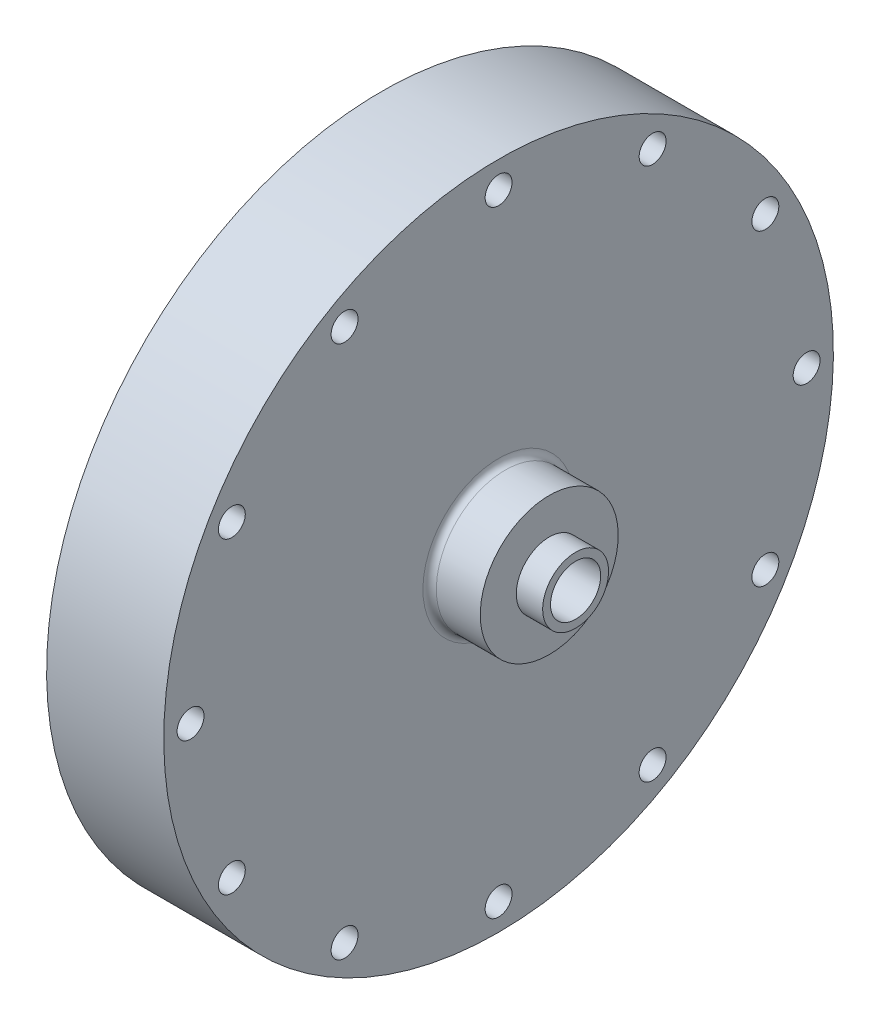
ISO-10303-21;
HEADER;
FILE_DESCRIPTION(('STEP AP214'),'2;1');
FILE_NAME('part.step','',(''),(''),'','','');
FILE_SCHEMA(('AUTOMOTIVE_DESIGN { 1 0 10303 214 1 1 1 1 }'));
ENDSEC;
DATA;
#1=APPLICATION_CONTEXT('core data for automotive mechanical design processes');
#2=APPLICATION_PROTOCOL_DEFINITION('international standard','automotive_design',2000,#1);
#3=PRODUCT_CONTEXT('',#1,'mechanical');
#4=PRODUCT('Part','Part','',(#3));
#5=PRODUCT_RELATED_PRODUCT_CATEGORY('part','',(#4));
#6=PRODUCT_DEFINITION_FORMATION('','',#4);
#7=PRODUCT_DEFINITION_CONTEXT('part definition',#1,'design');
#8=PRODUCT_DEFINITION('design','',#6,#7);
#9=PRODUCT_DEFINITION_SHAPE('','',#8);
#10=(LENGTH_UNIT() NAMED_UNIT(*) SI_UNIT(.MILLI.,.METRE.));
#11=(NAMED_UNIT(*) PLANE_ANGLE_UNIT() SI_UNIT($,.RADIAN.));
#12=(NAMED_UNIT(*) SI_UNIT($,.STERADIAN.) SOLID_ANGLE_UNIT());
#13=UNCERTAINTY_MEASURE_WITH_UNIT(LENGTH_MEASURE(1.E-05),#10,'distance_accuracy_value','');
#14=(GEOMETRIC_REPRESENTATION_CONTEXT(3) GLOBAL_UNCERTAINTY_ASSIGNED_CONTEXT((#13)) GLOBAL_UNIT_ASSIGNED_CONTEXT((#10,
#11,#12)) REPRESENTATION_CONTEXT('',''));
#15=CARTESIAN_POINT('',(0.,0.,0.));
#16=DIRECTION('',(0.,0.,1.));
#17=DIRECTION('',(1.,0.,0.));
#18=AXIS2_PLACEMENT_3D('',#15,#16,#17);
#19=CARTESIAN_POINT('',(9.525,0.,0.));
#20=DIRECTION('',(1.,0.,0.));
#21=DIRECTION('',(0.,1.,0.));
#22=AXIS2_PLACEMENT_3D('',#19,#20,#21);
#23=PLANE('',#22);
#24=CARTESIAN_POINT('',(9.525,23.5731723178062,23.5731723178068));
#25=DIRECTION('',(-1.,0.,0.));
#26=DIRECTION('',(0.,0.,1.));
#27=AXIS2_PLACEMENT_3D('',#24,#25,#26);
#28=CIRCLE('',#27,1.13029999999999);
#29=CARTESIAN_POINT('',(9.525,23.5731723178062,24.7034723178068));
#30=VERTEX_POINT('',#29);
#31=EDGE_CURVE('E92',#30,#30,#28,.T.);
#32=ORIENTED_EDGE('',*,*,#31,.F.);
#33=EDGE_LOOP('',(#32));
#34=FACE_BOUND('',#33,.T.);
#35=CARTESIAN_POINT('',(9.525,33.3375,3.49191777401049E-13));
#36=DIRECTION('',(-1.,0.,0.));
#37=DIRECTION('',(0.,0.,1.));
#38=AXIS2_PLACEMENT_3D('',#35,#36,#37);
#39=CIRCLE('',#38,1.13029999999999);
#40=CARTESIAN_POINT('',(9.525,33.3375,1.13030000000034));
#41=VERTEX_POINT('',#40);
#42=EDGE_CURVE('E91',#41,#41,#39,.T.);
#43=ORIENTED_EDGE('',*,*,#42,.F.);
#44=EDGE_LOOP('',(#43));
#45=FACE_BOUND('',#44,.T.);
#46=CARTESIAN_POINT('',(9.525,0.,-33.3375));
#47=DIRECTION('',(-1.,0.,0.));
#48=DIRECTION('',(0.,0.,1.));
#49=AXIS2_PLACEMENT_3D('',#46,#47,#48);
#50=CIRCLE('',#49,1.13029999999999);
#51=CARTESIAN_POINT('',(9.525,0.,-32.2072));
#52=VERTEX_POINT('',#51);
#53=EDGE_CURVE('E108',#52,#52,#50,.T.);
#54=ORIENTED_EDGE('',*,*,#53,.F.);
#55=EDGE_LOOP('',(#54));
#56=FACE_BOUND('',#55,.T.);
#57=CARTESIAN_POINT('',(9.525,-23.5731723178064,-23.5731723178067));
#58=DIRECTION('',(-1.,0.,0.));
#59=DIRECTION('',(0.,0.,1.));
#60=AXIS2_PLACEMENT_3D('',#57,#58,#59);
#61=CIRCLE('',#60,1.13029999999999);
#62=CARTESIAN_POINT('',(9.525,-23.5731723178064,-22.4428723178067));
#63=VERTEX_POINT('',#62);
#64=EDGE_CURVE('E114',#63,#63,#61,.T.);
#65=ORIENTED_EDGE('',*,*,#64,.F.);
#66=EDGE_LOOP('',(#65));
#67=FACE_BOUND('',#66,.T.);
#68=CARTESIAN_POINT('',(9.525,-33.3375,-1.16397259133683E-13));
#69=DIRECTION('',(-1.,0.,0.));
#70=DIRECTION('',(0.,0.,1.));
#71=AXIS2_PLACEMENT_3D('',#68,#69,#70);
#72=CIRCLE('',#71,1.13029999999999);
#73=CARTESIAN_POINT('',(9.525,-33.3375,1.13029999999987));
#74=VERTEX_POINT('',#73);
#75=EDGE_CURVE('E120',#74,#74,#72,.T.);
#76=ORIENTED_EDGE('',*,*,#75,.F.);
#77=EDGE_LOOP('',(#76));
#78=FACE_BOUND('',#77,.T.);
#79=CARTESIAN_POINT('',(9.525,-23.5731723178066,23.5731723178065));
#80=DIRECTION('',(-1.,0.,0.));
#81=DIRECTION('',(0.,0.,1.));
#82=AXIS2_PLACEMENT_3D('',#79,#80,#81);
#83=CIRCLE('',#82,1.13029999999999);
#84=CARTESIAN_POINT('',(9.525,-23.5731723178066,24.7034723178065));
#85=VERTEX_POINT('',#84);
#86=EDGE_CURVE('E126',#85,#85,#83,.T.);
#87=ORIENTED_EDGE('',*,*,#86,.F.);
#88=EDGE_LOOP('',(#87));
#89=FACE_BOUND('',#88,.T.);
#90=CARTESIAN_POINT('',(9.525,0.,33.3375));
#91=DIRECTION('',(-1.,0.,0.));
#92=DIRECTION('',(0.,0.,1.));
#93=AXIS2_PLACEMENT_3D('',#90,#91,#92);
#94=CIRCLE('',#93,1.13029999999999);
#95=CARTESIAN_POINT('',(9.525,0.,34.4678));
#96=VERTEX_POINT('',#95);
#97=EDGE_CURVE('E132',#96,#96,#94,.T.);
#98=ORIENTED_EDGE('',*,*,#97,.F.);
#99=EDGE_LOOP('',(#98));
#100=FACE_BOUND('',#99,.T.);
#101=CARTESIAN_POINT('',(9.525,0.,0.));
#102=DIRECTION('',(-1.,0.,0.));
#103=DIRECTION('',(0.,-1.,0.));
#104=AXIS2_PLACEMENT_3D('',#101,#102,#103);
#105=CIRCLE('',#104,28.575);
#106=CARTESIAN_POINT('',(9.525,-28.575,0.));
#107=VERTEX_POINT('',#106);
#108=EDGE_CURVE('E342',#107,#107,#105,.T.);
#109=ORIENTED_EDGE('',*,*,#108,.F.);
#110=EDGE_LOOP('',(#109));
#111=FACE_BOUND('',#110,.T.);
#112=CARTESIAN_POINT('',(9.525,-15.1202086148874,56.4293867718079));
#113=DIRECTION('',(-1.,0.,0.));
#114=DIRECTION('',(0.,0.,1.));
#115=AXIS2_PLACEMENT_3D('',#112,#113,#114);
#116=CIRCLE('',#115,2.38125);
#117=CARTESIAN_POINT('',(9.525,-15.1202086148874,58.8106367718079));
#118=VERTEX_POINT('',#117);
#119=EDGE_CURVE('E339',#118,#118,#116,.T.);
#120=ORIENTED_EDGE('',*,*,#119,.F.);
#121=EDGE_LOOP('',(#120));
#122=FACE_BOUND('',#121,.T.);
#123=CARTESIAN_POINT('',(9.525,15.120208614887,-56.429386771808));
#124=DIRECTION('',(-1.,0.,0.));
#125=DIRECTION('',(0.,0.,1.));
#126=AXIS2_PLACEMENT_3D('',#123,#124,#125);
#127=CIRCLE('',#126,2.38125);
#128=CARTESIAN_POINT('',(9.525,15.120208614887,-54.048136771808));
#129=VERTEX_POINT('',#128);
#130=EDGE_CURVE('E333',#129,#129,#127,.T.);
#131=ORIENTED_EDGE('',*,*,#130,.F.);
#132=EDGE_LOOP('',(#131));
#133=FACE_BOUND('',#132,.T.);
#134=CARTESIAN_POINT('',(9.525,-58.42,0.));
#135=DIRECTION('',(1.,0.,0.));
#136=DIRECTION('',(0.,1.,0.));
#137=AXIS2_PLACEMENT_3D('',#134,#135,#136);
#138=CIRCLE('',#137,2.5527);
#139=CARTESIAN_POINT('',(9.525,-55.8673,0.));
#140=VERTEX_POINT('',#139);
#141=EDGE_CURVE('E324',#140,#140,#138,.T.);
#142=ORIENTED_EDGE('',*,*,#141,.T.);
#143=EDGE_LOOP('',(#142));
#144=FACE_BOUND('',#143,.T.);
#145=CARTESIAN_POINT('',(9.525,-50.5932040890869,-29.21));
#146=DIRECTION('',(1.,0.,0.));
#147=DIRECTION('',(0.,1.,0.));
#148=AXIS2_PLACEMENT_3D('',#145,#146,#147);
#149=CIRCLE('',#148,2.5527);
#150=CARTESIAN_POINT('',(9.525,-48.0405040890869,-29.21));
#151=VERTEX_POINT('',#150);
#152=EDGE_CURVE('E318',#151,#151,#149,.T.);
#153=ORIENTED_EDGE('',*,*,#152,.T.);
#154=EDGE_LOOP('',(#153));
#155=FACE_BOUND('',#154,.T.);
#156=CARTESIAN_POINT('',(9.525,-29.21,-50.5932040890869));
#157=DIRECTION('',(1.,0.,0.));
#158=DIRECTION('',(0.,1.,0.));
#159=AXIS2_PLACEMENT_3D('',#156,#157,#158);
#160=CIRCLE('',#159,2.5527);
#161=CARTESIAN_POINT('',(9.525,-26.6573,-50.5932040890869));
#162=VERTEX_POINT('',#161);
#163=EDGE_CURVE('E312',#162,#162,#160,.T.);
#164=ORIENTED_EDGE('',*,*,#163,.T.);
#165=EDGE_LOOP('',(#164));
#166=FACE_BOUND('',#165,.T.);
#167=CARTESIAN_POINT('',(9.525,0.,-58.42));
#168=DIRECTION('',(1.,0.,0.));
#169=DIRECTION('',(0.,1.,0.));
#170=AXIS2_PLACEMENT_3D('',#167,#168,#169);
#171=CIRCLE('',#170,2.5527);
#172=CARTESIAN_POINT('',(9.525,2.5527,-58.42));
#173=VERTEX_POINT('',#172);
#174=EDGE_CURVE('E306',#173,#173,#171,.T.);
#175=ORIENTED_EDGE('',*,*,#174,.T.);
#176=EDGE_LOOP('',(#175));
#177=FACE_BOUND('',#176,.T.);
#178=CARTESIAN_POINT('',(9.525,29.21,-50.5932040890869));
#179=DIRECTION('',(1.,0.,0.));
#180=DIRECTION('',(0.,1.,0.));
#181=AXIS2_PLACEMENT_3D('',#178,#179,#180);
#182=CIRCLE('',#181,2.55269999999999);
#183=CARTESIAN_POINT('',(9.525,31.7627,-50.5932040890869));
#184=VERTEX_POINT('',#183);
#185=EDGE_CURVE('E300',#184,#184,#182,.T.);
#186=ORIENTED_EDGE('',*,*,#185,.T.);
#187=EDGE_LOOP('',(#186));
#188=FACE_BOUND('',#187,.T.);
#189=CARTESIAN_POINT('',(9.525,50.5932040890869,-29.21));
#190=DIRECTION('',(1.,0.,0.));
#191=DIRECTION('',(0.,1.,0.));
#192=AXIS2_PLACEMENT_3D('',#189,#190,#191);
#193=CIRCLE('',#192,2.5527);
#194=CARTESIAN_POINT('',(9.525,53.1459040890869,-29.21));
#195=VERTEX_POINT('',#194);
#196=EDGE_CURVE('E294',#195,#195,#193,.T.);
#197=ORIENTED_EDGE('',*,*,#196,.T.);
#198=EDGE_LOOP('',(#197));
#199=FACE_BOUND('',#198,.T.);
#200=CARTESIAN_POINT('',(9.525,58.42,0.));
#201=DIRECTION('',(1.,0.,0.));
#202=DIRECTION('',(0.,1.,0.));
#203=AXIS2_PLACEMENT_3D('',#200,#201,#202);
#204=CIRCLE('',#203,2.5527);
#205=CARTESIAN_POINT('',(9.525,60.9727,0.));
#206=VERTEX_POINT('',#205);
#207=EDGE_CURVE('E288',#206,#206,#204,.T.);
#208=ORIENTED_EDGE('',*,*,#207,.T.);
#209=EDGE_LOOP('',(#208));
#210=FACE_BOUND('',#209,.T.);
#211=CARTESIAN_POINT('',(9.525,50.5932040890869,29.21));
#212=DIRECTION('',(1.,0.,0.));
#213=DIRECTION('',(0.,1.,0.));
#214=AXIS2_PLACEMENT_3D('',#211,#212,#213);
#215=CIRCLE('',#214,2.5527);
#216=CARTESIAN_POINT('',(9.525,53.1459040890869,29.21));
#217=VERTEX_POINT('',#216);
#218=EDGE_CURVE('E282',#217,#217,#215,.T.);
#219=ORIENTED_EDGE('',*,*,#218,.T.);
#220=EDGE_LOOP('',(#219));
#221=FACE_BOUND('',#220,.T.);
#222=CARTESIAN_POINT('',(9.525,29.21,50.5932040890869));
#223=DIRECTION('',(1.,0.,0.));
#224=DIRECTION('',(0.,1.,0.));
#225=AXIS2_PLACEMENT_3D('',#222,#223,#224);
#226=CIRCLE('',#225,2.5527);
#227=CARTESIAN_POINT('',(9.525,31.7627,50.5932040890869));
#228=VERTEX_POINT('',#227);
#229=EDGE_CURVE('E276',#228,#228,#226,.T.);
#230=ORIENTED_EDGE('',*,*,#229,.T.);
#231=EDGE_LOOP('',(#230));
#232=FACE_BOUND('',#231,.T.);
#233=CARTESIAN_POINT('',(9.525,0.,58.42));
#234=DIRECTION('',(1.,0.,0.));
#235=DIRECTION('',(0.,1.,0.));
#236=AXIS2_PLACEMENT_3D('',#233,#234,#235);
#237=CIRCLE('',#236,2.5527);
#238=CARTESIAN_POINT('',(9.525,2.5527,58.42));
#239=VERTEX_POINT('',#238);
#240=EDGE_CURVE('E270',#239,#239,#237,.T.);
#241=ORIENTED_EDGE('',*,*,#240,.T.);
#242=EDGE_LOOP('',(#241));
#243=FACE_BOUND('',#242,.T.);
#244=CARTESIAN_POINT('',(9.525,-29.21,50.5932040890869));
#245=DIRECTION('',(1.,0.,0.));
#246=DIRECTION('',(0.,1.,0.));
#247=AXIS2_PLACEMENT_3D('',#244,#245,#246);
#248=CIRCLE('',#247,2.5527);
#249=CARTESIAN_POINT('',(9.525,-26.6573,50.5932040890869));
#250=VERTEX_POINT('',#249);
#251=EDGE_CURVE('E264',#250,#250,#248,.T.);
#252=ORIENTED_EDGE('',*,*,#251,.T.);
#253=EDGE_LOOP('',(#252));
#254=FACE_BOUND('',#253,.T.);
#255=CARTESIAN_POINT('',(9.525,-50.5932040890869,29.21));
#256=DIRECTION('',(1.,0.,0.));
#257=DIRECTION('',(0.,1.,0.));
#258=AXIS2_PLACEMENT_3D('',#255,#256,#257);
#259=CIRCLE('',#258,2.5527);
#260=CARTESIAN_POINT('',(9.525,-48.0405040890869,29.21));
#261=VERTEX_POINT('',#260);
#262=EDGE_CURVE('E250',#261,#261,#259,.T.);
#263=ORIENTED_EDGE('',*,*,#262,.T.);
#264=EDGE_LOOP('',(#263));
#265=FACE_BOUND('',#264,.T.);
#266=CARTESIAN_POINT('',(9.525,0.,0.));
#267=DIRECTION('',(-1.,0.,0.));
#268=DIRECTION('',(0.,-1.,0.));
#269=AXIS2_PLACEMENT_3D('',#266,#267,#268);
#270=CIRCLE('',#269,63.5);
#271=CARTESIAN_POINT('',(9.525,-63.5,0.));
#272=VERTEX_POINT('',#271);
#273=EDGE_CURVE('E242',#272,#272,#270,.T.);
#274=ORIENTED_EDGE('',*,*,#273,.T.);
#275=EDGE_LOOP('',(#274));
#276=FACE_BOUND('',#275,.T.);
#277=CARTESIAN_POINT('',(9.525,23.5731723178067,-23.5731723178063));
#278=DIRECTION('',(-1.,0.,0.));
#279=DIRECTION('',(0.,0.,1.));
#280=AXIS2_PLACEMENT_3D('',#277,#278,#279);
#281=CIRCLE('',#280,1.13029999999999);
#282=CARTESIAN_POINT('',(9.525,23.5731723178067,-22.4428723178063));
#283=VERTEX_POINT('',#282);
#284=EDGE_CURVE('E102',#283,#283,#281,.T.);
#285=ORIENTED_EDGE('',*,*,#284,.F.);
#286=EDGE_LOOP('',(#285));
#287=FACE_BOUND('',#286,.T.);
#288=ADVANCED_FACE('F42',(#34,#45,#56,#67,#78,#89,#100,#111,#122,#133,#144,#155,#166,#177,#188,
#199,#210,#221,#232,#243,#254,#265,#276,#287),#23,.F.);
#289=CARTESIAN_POINT('',(9.525,0.,0.));
#290=DIRECTION('',(1.,0.,0.));
#291=DIRECTION('',(0.,0.,-1.));
#292=AXIS2_PLACEMENT_3D('',#289,#290,#291);
#293=CYLINDRICAL_SURFACE('',#292,4.7625);
#294=CARTESIAN_POINT('',(30.48,0.,0.));
#295=DIRECTION('',(-1.,0.,0.));
#296=DIRECTION('',(0.,-1.,0.));
#297=AXIS2_PLACEMENT_3D('',#294,#295,#296);
#298=CIRCLE('',#297,4.7625);
#299=CARTESIAN_POINT('',(30.48,-4.7625,0.));
#300=VERTEX_POINT('',#299);
#301=EDGE_CURVE('E175',#300,#300,#298,.T.);
#302=ORIENTED_EDGE('',*,*,#301,.T.);
#303=EDGE_LOOP('',(#302));
#304=FACE_BOUND('',#303,.T.);
#305=CARTESIAN_POINT('',(46.355,0.,0.));
#306=DIRECTION('',(1.,0.,0.));
#307=DIRECTION('',(0.,0.,-1.));
#308=AXIS2_PLACEMENT_3D('',#305,#306,#307);
#309=CIRCLE('',#308,4.7625);
#310=CARTESIAN_POINT('',(46.355,0.,-4.7625));
#311=VERTEX_POINT('',#310);
#312=EDGE_CURVE('E245',#311,#311,#309,.T.);
#313=ORIENTED_EDGE('',*,*,#312,.T.);
#314=EDGE_LOOP('',(#313));
#315=FACE_BOUND('',#314,.T.);
#316=ADVANCED_FACE('F202',(#304,#315),#293,.F.);
#317=CARTESIAN_POINT('',(31.75,63.5,0.));
#318=DIRECTION('',(-1.,0.,0.));
#319=DIRECTION('',(0.,-1.,0.));
#320=AXIS2_PLACEMENT_3D('',#317,#318,#319);
#321=PLANE('',#320);
#322=CARTESIAN_POINT('',(31.75,0.,0.));
#323=DIRECTION('',(-1.,0.,0.));
#324=DIRECTION('',(0.,-1.,0.));
#325=AXIS2_PLACEMENT_3D('',#322,#323,#324);
#326=CIRCLE('',#325,14.351);
#327=CARTESIAN_POINT('',(31.75,-14.351,0.));
#328=VERTEX_POINT('',#327);
#329=EDGE_CURVE('E50',#328,#328,#326,.T.);
#330=ORIENTED_EDGE('',*,*,#329,.T.);
#331=EDGE_LOOP('',(#330));
#332=FACE_BOUND('',#331,.T.);
#333=CARTESIAN_POINT('',(31.75,50.5932040890869,-29.21));
#334=DIRECTION('',(1.,0.,0.));
#335=DIRECTION('',(0.,0.,-1.));
#336=AXIS2_PLACEMENT_3D('',#333,#334,#335);
#337=CIRCLE('',#336,2.5527);
#338=CARTESIAN_POINT('',(31.75,50.5932040890869,-31.7627));
#339=VERTEX_POINT('',#338);
#340=EDGE_CURVE('E297',#339,#339,#337,.T.);
#341=ORIENTED_EDGE('',*,*,#340,.F.);
#342=EDGE_LOOP('',(#341));
#343=FACE_BOUND('',#342,.T.);
#344=CARTESIAN_POINT('',(31.75,50.5932040890869,29.21));
#345=DIRECTION('',(1.,0.,0.));
#346=DIRECTION('',(0.,0.,-1.));
#347=AXIS2_PLACEMENT_3D('',#344,#345,#346);
#348=CIRCLE('',#347,2.5527);
#349=CARTESIAN_POINT('',(31.75,50.5932040890869,26.6573));
#350=VERTEX_POINT('',#349);
#351=EDGE_CURVE('E285',#350,#350,#348,.T.);
#352=ORIENTED_EDGE('',*,*,#351,.F.);
#353=EDGE_LOOP('',(#352));
#354=FACE_BOUND('',#353,.T.);
#355=CARTESIAN_POINT('',(31.75,29.21,50.5932040890869));
#356=DIRECTION('',(1.,0.,0.));
#357=DIRECTION('',(0.,0.,-1.));
#358=AXIS2_PLACEMENT_3D('',#355,#356,#357);
#359=CIRCLE('',#358,2.5527);
#360=CARTESIAN_POINT('',(31.75,29.21,48.0405040890869));
#361=VERTEX_POINT('',#360);
#362=EDGE_CURVE('E279',#361,#361,#359,.T.);
#363=ORIENTED_EDGE('',*,*,#362,.F.);
#364=EDGE_LOOP('',(#363));
#365=FACE_BOUND('',#364,.T.);
#366=CARTESIAN_POINT('',(31.75,-50.5932040890869,29.21));
#367=DIRECTION('',(1.,0.,0.));
#368=DIRECTION('',(0.,0.,-1.));
#369=AXIS2_PLACEMENT_3D('',#366,#367,#368);
#370=CIRCLE('',#369,2.5527);
#371=CARTESIAN_POINT('',(31.75,-50.5932040890869,26.6573));
#372=VERTEX_POINT('',#371);
#373=EDGE_CURVE('E261',#372,#372,#370,.T.);
#374=ORIENTED_EDGE('',*,*,#373,.F.);
#375=EDGE_LOOP('',(#374));
#376=FACE_BOUND('',#375,.T.);
#377=CARTESIAN_POINT('',(31.75,0.,0.));
#378=DIRECTION('',(-1.,0.,0.));
#379=DIRECTION('',(0.,-1.,0.));
#380=AXIS2_PLACEMENT_3D('',#377,#378,#379);
#381=CIRCLE('',#380,63.5);
#382=CARTESIAN_POINT('',(31.75,-63.5,0.));
#383=VERTEX_POINT('',#382);
#384=EDGE_CURVE('E183',#383,#383,#381,.T.);
#385=ORIENTED_EDGE('',*,*,#384,.F.);
#386=EDGE_LOOP('',(#385));
#387=FACE_BOUND('',#386,.T.);
#388=CARTESIAN_POINT('',(31.75,-29.21,50.5932040890869));
#389=DIRECTION('',(1.,0.,0.));
#390=DIRECTION('',(0.,0.,-1.));
#391=AXIS2_PLACEMENT_3D('',#388,#389,#390);
#392=CIRCLE('',#391,2.5527);
#393=CARTESIAN_POINT('',(31.75,-29.21,48.0405040890869));
#394=VERTEX_POINT('',#393);
#395=EDGE_CURVE('E267',#394,#394,#392,.T.);
#396=ORIENTED_EDGE('',*,*,#395,.F.);
#397=EDGE_LOOP('',(#396));
#398=FACE_BOUND('',#397,.T.);
#399=CARTESIAN_POINT('',(31.75,0.,58.42));
#400=DIRECTION('',(1.,0.,0.));
#401=DIRECTION('',(0.,0.,-1.));
#402=AXIS2_PLACEMENT_3D('',#399,#400,#401);
#403=CIRCLE('',#402,2.5527);
#404=CARTESIAN_POINT('',(31.75,0.,55.8673));
#405=VERTEX_POINT('',#404);
#406=EDGE_CURVE('E273',#405,#405,#403,.T.);
#407=ORIENTED_EDGE('',*,*,#406,.F.);
#408=EDGE_LOOP('',(#407));
#409=FACE_BOUND('',#408,.T.);
#410=CARTESIAN_POINT('',(31.75,58.42,0.));
#411=DIRECTION('',(1.,0.,0.));
#412=DIRECTION('',(0.,0.,-1.));
#413=AXIS2_PLACEMENT_3D('',#410,#411,#412);
#414=CIRCLE('',#413,2.5527);
#415=CARTESIAN_POINT('',(31.75,58.42,-2.5527));
#416=VERTEX_POINT('',#415);
#417=EDGE_CURVE('E291',#416,#416,#414,.T.);
#418=ORIENTED_EDGE('',*,*,#417,.F.);
#419=EDGE_LOOP('',(#418));
#420=FACE_BOUND('',#419,.T.);
#421=CARTESIAN_POINT('',(31.75,29.21,-50.5932040890869));
#422=DIRECTION('',(1.,0.,0.));
#423=DIRECTION('',(0.,0.,-1.));
#424=AXIS2_PLACEMENT_3D('',#421,#422,#423);
#425=CIRCLE('',#424,2.55269999999999);
#426=CARTESIAN_POINT('',(31.75,29.21,-53.1459040890869));
#427=VERTEX_POINT('',#426);
#428=EDGE_CURVE('E303',#427,#427,#425,.T.);
#429=ORIENTED_EDGE('',*,*,#428,.F.);
#430=EDGE_LOOP('',(#429));
#431=FACE_BOUND('',#430,.T.);
#432=CARTESIAN_POINT('',(31.75,0.,-58.42));
#433=DIRECTION('',(1.,0.,0.));
#434=DIRECTION('',(0.,0.,-1.));
#435=AXIS2_PLACEMENT_3D('',#432,#433,#434);
#436=CIRCLE('',#435,2.5527);
#437=CARTESIAN_POINT('',(31.75,0.,-60.9727));
#438=VERTEX_POINT('',#437);
#439=EDGE_CURVE('E309',#438,#438,#436,.T.);
#440=ORIENTED_EDGE('',*,*,#439,.F.);
#441=EDGE_LOOP('',(#440));
#442=FACE_BOUND('',#441,.T.);
#443=CARTESIAN_POINT('',(31.75,-29.21,-50.5932040890869));
#444=DIRECTION('',(1.,0.,0.));
#445=DIRECTION('',(0.,0.,-1.));
#446=AXIS2_PLACEMENT_3D('',#443,#444,#445);
#447=CIRCLE('',#446,2.5527);
#448=CARTESIAN_POINT('',(31.75,-29.21,-53.1459040890869));
#449=VERTEX_POINT('',#448);
#450=EDGE_CURVE('E315',#449,#449,#447,.T.);
#451=ORIENTED_EDGE('',*,*,#450,.F.);
#452=EDGE_LOOP('',(#451));
#453=FACE_BOUND('',#452,.T.);
#454=CARTESIAN_POINT('',(31.75,-50.5932040890869,-29.21));
#455=DIRECTION('',(1.,0.,0.));
#456=DIRECTION('',(0.,0.,-1.));
#457=AXIS2_PLACEMENT_3D('',#454,#455,#456);
#458=CIRCLE('',#457,2.5527);
#459=CARTESIAN_POINT('',(31.75,-50.5932040890869,-31.7627));
#460=VERTEX_POINT('',#459);
#461=EDGE_CURVE('E321',#460,#460,#458,.T.);
#462=ORIENTED_EDGE('',*,*,#461,.F.);
#463=EDGE_LOOP('',(#462));
#464=FACE_BOUND('',#463,.T.);
#465=CARTESIAN_POINT('',(31.75,-58.42,0.));
#466=DIRECTION('',(1.,0.,0.));
#467=DIRECTION('',(0.,0.,-1.));
#468=AXIS2_PLACEMENT_3D('',#465,#466,#467);
#469=CIRCLE('',#468,2.5527);
#470=CARTESIAN_POINT('',(31.75,-58.42,-2.5527));
#471=VERTEX_POINT('',#470);
#472=EDGE_CURVE('E327',#471,#471,#469,.T.);
#473=ORIENTED_EDGE('',*,*,#472,.F.);
#474=EDGE_LOOP('',(#473));
#475=FACE_BOUND('',#474,.T.);
#476=ADVANCED_FACE('F212',(#332,#343,#354,#365,#376,#387,#398,#409,#420,#431,#442,#453,#464,
#475),#321,.F.);
#477=CARTESIAN_POINT('',(9.525,0.,0.));
#478=DIRECTION('',(-1.,0.,0.));
#479=DIRECTION('',(0.,-1.,0.));
#480=AXIS2_PLACEMENT_3D('',#477,#478,#479);
#481=CYLINDRICAL_SURFACE('',#480,63.5);
#482=ORIENTED_EDGE('',*,*,#273,.F.);
#483=EDGE_LOOP('',(#482));
#484=FACE_BOUND('',#483,.T.);
#485=ORIENTED_EDGE('',*,*,#384,.T.);
#486=EDGE_LOOP('',(#485));
#487=FACE_BOUND('',#486,.T.);
#488=ADVANCED_FACE('F233',(#484,#487),#481,.T.);
#489=CARTESIAN_POINT('',(9.525,0.,0.));
#490=DIRECTION('',(-1.,0.,0.));
#491=DIRECTION('',(0.,-1.,0.));
#492=AXIS2_PLACEMENT_3D('',#489,#490,#491);
#493=CYLINDRICAL_SURFACE('',#492,13.081);
#494=CARTESIAN_POINT('',(33.02,0.,0.));
#495=DIRECTION('',(-1.,0.,0.));
#496=DIRECTION('',(0.,-1.,0.));
#497=AXIS2_PLACEMENT_3D('',#494,#495,#496);
#498=CIRCLE('',#497,13.081);
#499=CARTESIAN_POINT('',(33.02,-13.081,0.));
#500=VERTEX_POINT('',#499);
#501=EDGE_CURVE('E12',#500,#500,#498,.F.);
#502=ORIENTED_EDGE('',*,*,#501,.T.);
#503=EDGE_LOOP('',(#502));
#504=FACE_BOUND('',#503,.T.);
#505=CARTESIAN_POINT('',(41.355,0.,0.));
#506=DIRECTION('',(-1.,0.,0.));
#507=DIRECTION('',(0.,-1.,0.));
#508=AXIS2_PLACEMENT_3D('',#505,#506,#507);
#509=CIRCLE('',#508,13.081);
#510=CARTESIAN_POINT('',(41.355,-13.081,0.));
#511=VERTEX_POINT('',#510);
#512=EDGE_CURVE('E187',#511,#511,#509,.T.);
#513=ORIENTED_EDGE('',*,*,#512,.T.);
#514=EDGE_LOOP('',(#513));
#515=FACE_BOUND('',#514,.T.);
#516=ADVANCED_FACE('F229',(#504,#515),#493,.T.);
#517=CARTESIAN_POINT('',(41.355,13.081,0.));
#518=DIRECTION('',(-1.,0.,0.));
#519=DIRECTION('',(0.,-1.,0.));
#520=AXIS2_PLACEMENT_3D('',#517,#518,#519);
#521=PLANE('',#520);
#522=ORIENTED_EDGE('',*,*,#512,.F.);
#523=EDGE_LOOP('',(#522));
#524=FACE_BOUND('',#523,.T.);
#525=CARTESIAN_POINT('',(41.355,0.,0.));
#526=DIRECTION('',(-1.,0.,0.));
#527=DIRECTION('',(0.,-1.,0.));
#528=AXIS2_PLACEMENT_3D('',#525,#526,#527);
#529=CIRCLE('',#528,6.2484);
#530=CARTESIAN_POINT('',(41.355,-6.2484,0.));
#531=VERTEX_POINT('',#530);
#532=EDGE_CURVE('E192',#531,#531,#529,.T.);
#533=ORIENTED_EDGE('',*,*,#532,.T.);
#534=EDGE_LOOP('',(#533));
#535=FACE_BOUND('',#534,.T.);
#536=ADVANCED_FACE('F225',(#524,#535),#521,.F.);
#537=CARTESIAN_POINT('',(9.525,0.,0.));
#538=DIRECTION('',(-1.,0.,0.));
#539=DIRECTION('',(0.,-1.,0.));
#540=AXIS2_PLACEMENT_3D('',#537,#538,#539);
#541=CYLINDRICAL_SURFACE('',#540,6.2484);
#542=ORIENTED_EDGE('',*,*,#532,.F.);
#543=EDGE_LOOP('',(#542));
#544=FACE_BOUND('',#543,.T.);
#545=CARTESIAN_POINT('',(46.355,0.,0.));
#546=DIRECTION('',(-1.,0.,0.));
#547=DIRECTION('',(0.,-1.,0.));
#548=AXIS2_PLACEMENT_3D('',#545,#546,#547);
#549=CIRCLE('',#548,6.2484);
#550=CARTESIAN_POINT('',(46.355,-6.2484,0.));
#551=VERTEX_POINT('',#550);
#552=EDGE_CURVE('E244',#551,#551,#549,.T.);
#553=ORIENTED_EDGE('',*,*,#552,.T.);
#554=EDGE_LOOP('',(#553));
#555=FACE_BOUND('',#554,.T.);
#556=ADVANCED_FACE('F221',(#544,#555),#541,.T.);
#557=CARTESIAN_POINT('',(46.355,6.2484,0.));
#558=DIRECTION('',(-1.,0.,0.));
#559=DIRECTION('',(0.,-1.,0.));
#560=AXIS2_PLACEMENT_3D('',#557,#558,#559);
#561=PLANE('',#560);
#562=ORIENTED_EDGE('',*,*,#312,.F.);
#563=EDGE_LOOP('',(#562));
#564=FACE_BOUND('',#563,.T.);
#565=ORIENTED_EDGE('',*,*,#552,.F.);
#566=EDGE_LOOP('',(#565));
#567=FACE_BOUND('',#566,.T.);
#568=ADVANCED_FACE('F218',(#564,#567),#561,.F.);
#569=CARTESIAN_POINT('',(31.75,-50.5932040890869,29.21));
#570=DIRECTION('',(1.,0.,0.));
#571=DIRECTION('',(0.,0.,-1.));
#572=AXIS2_PLACEMENT_3D('',#569,#570,#571);
#573=CYLINDRICAL_SURFACE('',#572,2.5527);
#574=ORIENTED_EDGE('',*,*,#262,.F.);
#575=EDGE_LOOP('',(#574));
#576=FACE_BOUND('',#575,.T.);
#577=ORIENTED_EDGE('',*,*,#373,.T.);
#578=EDGE_LOOP('',(#577));
#579=FACE_BOUND('',#578,.T.);
#580=ADVANCED_FACE('F213',(#576,#579),#573,.F.);
#581=CARTESIAN_POINT('',(31.75,-29.21,50.5932040890869));
#582=DIRECTION('',(1.,0.,0.));
#583=DIRECTION('',(0.,0.,-1.));
#584=AXIS2_PLACEMENT_3D('',#581,#582,#583);
#585=CYLINDRICAL_SURFACE('',#584,2.5527);
#586=ORIENTED_EDGE('',*,*,#251,.F.);
#587=EDGE_LOOP('',(#586));
#588=FACE_BOUND('',#587,.T.);
#589=ORIENTED_EDGE('',*,*,#395,.T.);
#590=EDGE_LOOP('',(#589));
#591=FACE_BOUND('',#590,.T.);
#592=ADVANCED_FACE('F561',(#588,#591),#585,.F.);
#593=CARTESIAN_POINT('',(31.75,0.,58.42));
#594=DIRECTION('',(1.,0.,0.));
#595=DIRECTION('',(0.,0.,-1.));
#596=AXIS2_PLACEMENT_3D('',#593,#594,#595);
#597=CYLINDRICAL_SURFACE('',#596,2.5527);
#598=ORIENTED_EDGE('',*,*,#240,.F.);
#599=EDGE_LOOP('',(#598));
#600=FACE_BOUND('',#599,.T.);
#601=ORIENTED_EDGE('',*,*,#406,.T.);
#602=EDGE_LOOP('',(#601));
#603=FACE_BOUND('',#602,.T.);
#604=ADVANCED_FACE('F553',(#600,#603),#597,.F.);
#605=CARTESIAN_POINT('',(31.75,29.21,50.5932040890869));
#606=DIRECTION('',(1.,0.,0.));
#607=DIRECTION('',(0.,0.,-1.));
#608=AXIS2_PLACEMENT_3D('',#605,#606,#607);
#609=CYLINDRICAL_SURFACE('',#608,2.5527);
#610=ORIENTED_EDGE('',*,*,#229,.F.);
#611=EDGE_LOOP('',(#610));
#612=FACE_BOUND('',#611,.T.);
#613=ORIENTED_EDGE('',*,*,#362,.T.);
#614=EDGE_LOOP('',(#613));
#615=FACE_BOUND('',#614,.T.);
#616=ADVANCED_FACE('F545',(#612,#615),#609,.F.);
#617=CARTESIAN_POINT('',(31.75,50.5932040890869,29.21));
#618=DIRECTION('',(1.,0.,0.));
#619=DIRECTION('',(0.,0.,-1.));
#620=AXIS2_PLACEMENT_3D('',#617,#618,#619);
#621=CYLINDRICAL_SURFACE('',#620,2.5527);
#622=ORIENTED_EDGE('',*,*,#218,.F.);
#623=EDGE_LOOP('',(#622));
#624=FACE_BOUND('',#623,.T.);
#625=ORIENTED_EDGE('',*,*,#351,.T.);
#626=EDGE_LOOP('',(#625));
#627=FACE_BOUND('',#626,.T.);
#628=ADVANCED_FACE('F537',(#624,#627),#621,.F.);
#629=CARTESIAN_POINT('',(31.75,58.42,0.));
#630=DIRECTION('',(1.,0.,0.));
#631=DIRECTION('',(0.,0.,-1.));
#632=AXIS2_PLACEMENT_3D('',#629,#630,#631);
#633=CYLINDRICAL_SURFACE('',#632,2.5527);
#634=ORIENTED_EDGE('',*,*,#207,.F.);
#635=EDGE_LOOP('',(#634));
#636=FACE_BOUND('',#635,.T.);
#637=ORIENTED_EDGE('',*,*,#417,.T.);
#638=EDGE_LOOP('',(#637));
#639=FACE_BOUND('',#638,.T.);
#640=ADVANCED_FACE('F529',(#636,#639),#633,.F.);
#641=CARTESIAN_POINT('',(31.75,50.5932040890869,-29.21));
#642=DIRECTION('',(1.,0.,0.));
#643=DIRECTION('',(0.,0.,-1.));
#644=AXIS2_PLACEMENT_3D('',#641,#642,#643);
#645=CYLINDRICAL_SURFACE('',#644,2.5527);
#646=ORIENTED_EDGE('',*,*,#196,.F.);
#647=EDGE_LOOP('',(#646));
#648=FACE_BOUND('',#647,.T.);
#649=ORIENTED_EDGE('',*,*,#340,.T.);
#650=EDGE_LOOP('',(#649));
#651=FACE_BOUND('',#650,.T.);
#652=ADVANCED_FACE('F521',(#648,#651),#645,.F.);
#653=CARTESIAN_POINT('',(31.75,29.21,-50.5932040890869));
#654=DIRECTION('',(1.,0.,0.));
#655=DIRECTION('',(0.,0.,-1.));
#656=AXIS2_PLACEMENT_3D('',#653,#654,#655);
#657=CYLINDRICAL_SURFACE('',#656,2.55269999999999);
#658=ORIENTED_EDGE('',*,*,#185,.F.);
#659=EDGE_LOOP('',(#658));
#660=FACE_BOUND('',#659,.T.);
#661=ORIENTED_EDGE('',*,*,#428,.T.);
#662=EDGE_LOOP('',(#661));
#663=FACE_BOUND('',#662,.T.);
#664=ADVANCED_FACE('F513',(#660,#663),#657,.F.);
#665=CARTESIAN_POINT('',(31.75,0.,-58.42));
#666=DIRECTION('',(1.,0.,0.));
#667=DIRECTION('',(0.,0.,-1.));
#668=AXIS2_PLACEMENT_3D('',#665,#666,#667);
#669=CYLINDRICAL_SURFACE('',#668,2.5527);
#670=ORIENTED_EDGE('',*,*,#174,.F.);
#671=EDGE_LOOP('',(#670));
#672=FACE_BOUND('',#671,.T.);
#673=ORIENTED_EDGE('',*,*,#439,.T.);
#674=EDGE_LOOP('',(#673));
#675=FACE_BOUND('',#674,.T.);
#676=ADVANCED_FACE('F505',(#672,#675),#669,.F.);
#677=CARTESIAN_POINT('',(31.75,-29.21,-50.5932040890869));
#678=DIRECTION('',(1.,0.,0.));
#679=DIRECTION('',(0.,0.,-1.));
#680=AXIS2_PLACEMENT_3D('',#677,#678,#679);
#681=CYLINDRICAL_SURFACE('',#680,2.5527);
#682=ORIENTED_EDGE('',*,*,#163,.F.);
#683=EDGE_LOOP('',(#682));
#684=FACE_BOUND('',#683,.T.);
#685=ORIENTED_EDGE('',*,*,#450,.T.);
#686=EDGE_LOOP('',(#685));
#687=FACE_BOUND('',#686,.T.);
#688=ADVANCED_FACE('F497',(#684,#687),#681,.F.);
#689=CARTESIAN_POINT('',(31.75,-50.5932040890869,-29.21));
#690=DIRECTION('',(1.,0.,0.));
#691=DIRECTION('',(0.,0.,-1.));
#692=AXIS2_PLACEMENT_3D('',#689,#690,#691);
#693=CYLINDRICAL_SURFACE('',#692,2.5527);
#694=ORIENTED_EDGE('',*,*,#152,.F.);
#695=EDGE_LOOP('',(#694));
#696=FACE_BOUND('',#695,.T.);
#697=ORIENTED_EDGE('',*,*,#461,.T.);
#698=EDGE_LOOP('',(#697));
#699=FACE_BOUND('',#698,.T.);
#700=ADVANCED_FACE('F489',(#696,#699),#693,.F.);
#701=CARTESIAN_POINT('',(31.75,-58.42,0.));
#702=DIRECTION('',(1.,0.,0.));
#703=DIRECTION('',(0.,0.,-1.));
#704=AXIS2_PLACEMENT_3D('',#701,#702,#703);
#705=CYLINDRICAL_SURFACE('',#704,2.5527);
#706=ORIENTED_EDGE('',*,*,#141,.F.);
#707=EDGE_LOOP('',(#706));
#708=FACE_BOUND('',#707,.T.);
#709=ORIENTED_EDGE('',*,*,#472,.T.);
#710=EDGE_LOOP('',(#709));
#711=FACE_BOUND('',#710,.T.);
#712=ADVANCED_FACE('F482',(#708,#711),#705,.F.);
#713=CARTESIAN_POINT('',(15.875,15.120208614887,-56.429386771808));
#714=DIRECTION('',(-1.,0.,0.));
#715=DIRECTION('',(0.,0.,1.));
#716=AXIS2_PLACEMENT_3D('',#713,#714,#715);
#717=CONICAL_SURFACE('',#716,2.38124999999999,1.02974425867665);
#718=CARTESIAN_POINT('',(17.3057993490594,15.120208614887,-56.429386771808));
#719=VERTEX_POINT('',#718);
#720=VERTEX_LOOP('',#719);
#721=FACE_BOUND('',#720,.T.);
#722=CARTESIAN_POINT('',(15.875,15.120208614887,-56.429386771808));
#723=DIRECTION('',(-1.,0.,0.));
#724=DIRECTION('',(0.,0.,1.));
#725=AXIS2_PLACEMENT_3D('',#722,#723,#724);
#726=CIRCLE('',#725,2.38124999999999);
#727=CARTESIAN_POINT('',(15.875,15.120208614887,-54.048136771808));
#728=VERTEX_POINT('',#727);
#729=EDGE_CURVE('E330',#728,#728,#726,.T.);
#730=ORIENTED_EDGE('',*,*,#729,.T.);
#731=EDGE_LOOP('',(#730));
#732=FACE_BOUND('',#731,.T.);
#733=ADVANCED_FACE('F474',(#721,#732),#717,.F.);
#734=CARTESIAN_POINT('',(9.525,15.120208614887,-56.429386771808));
#735=DIRECTION('',(-1.,0.,0.));
#736=DIRECTION('',(0.,0.,1.));
#737=AXIS2_PLACEMENT_3D('',#734,#735,#736);
#738=CYLINDRICAL_SURFACE('',#737,2.38125);
#739=ORIENTED_EDGE('',*,*,#729,.F.);
#740=EDGE_LOOP('',(#739));
#741=FACE_BOUND('',#740,.T.);
#742=ORIENTED_EDGE('',*,*,#130,.T.);
#743=EDGE_LOOP('',(#742));
#744=FACE_BOUND('',#743,.T.);
#745=ADVANCED_FACE('F467',(#741,#744),#738,.F.);
#746=CARTESIAN_POINT('',(15.875,-15.1202086148874,56.4293867718079));
#747=DIRECTION('',(-1.,0.,0.));
#748=DIRECTION('',(0.,0.,1.));
#749=AXIS2_PLACEMENT_3D('',#746,#747,#748);
#750=CONICAL_SURFACE('',#749,2.38125,1.02974425867665);
#751=CARTESIAN_POINT('',(17.3057993490594,-15.1202086148874,56.4293867718079));
#752=VERTEX_POINT('',#751);
#753=VERTEX_LOOP('',#752);
#754=FACE_BOUND('',#753,.T.);
#755=CARTESIAN_POINT('',(15.875,-15.1202086148874,56.4293867718079));
#756=DIRECTION('',(-1.,0.,0.));
#757=DIRECTION('',(0.,0.,1.));
#758=AXIS2_PLACEMENT_3D('',#755,#756,#757);
#759=CIRCLE('',#758,2.38125);
#760=CARTESIAN_POINT('',(15.875,-15.1202086148874,58.8106367718079));
#761=VERTEX_POINT('',#760);
#762=EDGE_CURVE('E336',#761,#761,#759,.T.);
#763=ORIENTED_EDGE('',*,*,#762,.T.);
#764=EDGE_LOOP('',(#763));
#765=FACE_BOUND('',#764,.T.);
#766=ADVANCED_FACE('F460',(#754,#765),#750,.F.);
#767=CARTESIAN_POINT('',(9.525,-15.1202086148874,56.4293867718079));
#768=DIRECTION('',(-1.,0.,0.));
#769=DIRECTION('',(0.,0.,1.));
#770=AXIS2_PLACEMENT_3D('',#767,#768,#769);
#771=CYLINDRICAL_SURFACE('',#770,2.38125);
#772=ORIENTED_EDGE('',*,*,#762,.F.);
#773=EDGE_LOOP('',(#772));
#774=FACE_BOUND('',#773,.T.);
#775=ORIENTED_EDGE('',*,*,#119,.T.);
#776=EDGE_LOOP('',(#775));
#777=FACE_BOUND('',#776,.T.);
#778=ADVANCED_FACE('F452',(#774,#777),#771,.F.);
#779=CARTESIAN_POINT('',(19.05,0.,0.));
#780=DIRECTION('',(-1.,0.,0.));
#781=DIRECTION('',(0.,-1.,0.));
#782=AXIS2_PLACEMENT_3D('',#779,#780,#781);
#783=CYLINDRICAL_SURFACE('',#782,28.575);
#784=CARTESIAN_POINT('',(19.05,0.,0.));
#785=DIRECTION('',(-1.,0.,0.));
#786=DIRECTION('',(0.,-1.,0.));
#787=AXIS2_PLACEMENT_3D('',#784,#785,#786);
#788=CIRCLE('',#787,28.575);
#789=CARTESIAN_POINT('',(19.05,-28.575,0.));
#790=VERTEX_POINT('',#789);
#791=EDGE_CURVE('E138',#790,#790,#788,.T.);
#792=ORIENTED_EDGE('',*,*,#791,.F.);
#793=EDGE_LOOP('',(#792));
#794=FACE_BOUND('',#793,.T.);
#795=ORIENTED_EDGE('',*,*,#108,.T.);
#796=EDGE_LOOP('',(#795));
#797=FACE_BOUND('',#796,.T.);
#798=ADVANCED_FACE('F160',(#794,#797),#783,.F.);
#799=CARTESIAN_POINT('',(30.48,0.,0.));
#800=DIRECTION('',(-1.,0.,0.));
#801=DIRECTION('',(0.,-1.,0.));
#802=AXIS2_PLACEMENT_3D('',#799,#800,#801);
#803=CONICAL_SURFACE('',#802,4.7625,1.12327635163773);
#804=ORIENTED_EDGE('',*,*,#791,.T.);
#805=EDGE_LOOP('',(#804));
#806=FACE_BOUND('',#805,.T.);
#807=ORIENTED_EDGE('',*,*,#301,.F.);
#808=EDGE_LOOP('',(#807));
#809=FACE_BOUND('',#808,.T.);
#810=ADVANCED_FACE('F149',(#806,#809),#803,.F.);
#811=CARTESIAN_POINT('',(22.733,0.,33.3375));
#812=DIRECTION('',(-1.,0.,0.));
#813=DIRECTION('',(0.,0.,1.));
#814=AXIS2_PLACEMENT_3D('',#811,#812,#813);
#815=CONICAL_SURFACE('',#814,1.1303,1.02974425867665);
#816=CARTESIAN_POINT('',(23.4121527576869,0.,33.3375));
#817=VERTEX_POINT('',#816);
#818=VERTEX_LOOP('',#817);
#819=FACE_BOUND('',#818,.T.);
#820=CARTESIAN_POINT('',(22.733,0.,33.3375));
#821=DIRECTION('',(-1.,0.,0.));
#822=DIRECTION('',(0.,0.,1.));
#823=AXIS2_PLACEMENT_3D('',#820,#821,#822);
#824=CIRCLE('',#823,1.1303);
#825=CARTESIAN_POINT('',(22.733,0.,34.4678));
#826=VERTEX_POINT('',#825);
#827=EDGE_CURVE('E135',#826,#826,#824,.T.);
#828=ORIENTED_EDGE('',*,*,#827,.T.);
#829=EDGE_LOOP('',(#828));
#830=FACE_BOUND('',#829,.T.);
#831=ADVANCED_FACE('F159',(#819,#830),#815,.F.);
#832=CARTESIAN_POINT('',(9.525,0.,33.3375));
#833=DIRECTION('',(-1.,0.,0.));
#834=DIRECTION('',(0.,0.,1.));
#835=AXIS2_PLACEMENT_3D('',#832,#833,#834);
#836=CYLINDRICAL_SURFACE('',#835,1.13029999999999);
#837=ORIENTED_EDGE('',*,*,#827,.F.);
#838=EDGE_LOOP('',(#837));
#839=FACE_BOUND('',#838,.T.);
#840=ORIENTED_EDGE('',*,*,#97,.T.);
#841=EDGE_LOOP('',(#840));
#842=FACE_BOUND('',#841,.T.);
#843=ADVANCED_FACE('F426',(#839,#842),#836,.F.);
#844=CARTESIAN_POINT('',(22.733,-23.5731723178066,23.5731723178065));
#845=DIRECTION('',(-1.,0.,0.));
#846=DIRECTION('',(0.,0.,1.));
#847=AXIS2_PLACEMENT_3D('',#844,#845,#846);
#848=CONICAL_SURFACE('',#847,1.1303,1.02974425867665);
#849=CARTESIAN_POINT('',(23.4121527576869,-23.5731723178066,23.5731723178065));
#850=VERTEX_POINT('',#849);
#851=VERTEX_LOOP('',#850);
#852=FACE_BOUND('',#851,.T.);
#853=CARTESIAN_POINT('',(22.733,-23.5731723178066,23.5731723178065));
#854=DIRECTION('',(-1.,0.,0.));
#855=DIRECTION('',(0.,0.,1.));
#856=AXIS2_PLACEMENT_3D('',#853,#854,#855);
#857=CIRCLE('',#856,1.1303);
#858=CARTESIAN_POINT('',(22.733,-23.5731723178066,24.7034723178065));
#859=VERTEX_POINT('',#858);
#860=EDGE_CURVE('E129',#859,#859,#857,.T.);
#861=ORIENTED_EDGE('',*,*,#860,.T.);
#862=EDGE_LOOP('',(#861));
#863=FACE_BOUND('',#862,.T.);
#864=ADVANCED_FACE('F423',(#852,#863),#848,.F.);
#865=CARTESIAN_POINT('',(9.525,-23.5731723178066,23.5731723178065));
#866=DIRECTION('',(-1.,0.,0.));
#867=DIRECTION('',(0.,0.,1.));
#868=AXIS2_PLACEMENT_3D('',#865,#866,#867);
#869=CYLINDRICAL_SURFACE('',#868,1.13029999999999);
#870=ORIENTED_EDGE('',*,*,#860,.F.);
#871=EDGE_LOOP('',(#870));
#872=FACE_BOUND('',#871,.T.);
#873=ORIENTED_EDGE('',*,*,#86,.T.);
#874=EDGE_LOOP('',(#873));
#875=FACE_BOUND('',#874,.T.);
#876=ADVANCED_FACE('F419',(#872,#875),#869,.F.);
#877=CARTESIAN_POINT('',(22.733,-33.3375,-1.16397259133683E-13));
#878=DIRECTION('',(-1.,0.,0.));
#879=DIRECTION('',(0.,0.,1.));
#880=AXIS2_PLACEMENT_3D('',#877,#878,#879);
#881=CONICAL_SURFACE('',#880,1.13029999999999,1.02974425867665);
#882=CARTESIAN_POINT('',(23.4121527576869,-33.3375,-1.16397259133683E-13));
#883=VERTEX_POINT('',#882);
#884=VERTEX_LOOP('',#883);
#885=FACE_BOUND('',#884,.T.);
#886=CARTESIAN_POINT('',(22.733,-33.3375,-1.16397259133683E-13));
#887=DIRECTION('',(-1.,0.,0.));
#888=DIRECTION('',(0.,0.,1.));
#889=AXIS2_PLACEMENT_3D('',#886,#887,#888);
#890=CIRCLE('',#889,1.13029999999999);
#891=CARTESIAN_POINT('',(22.733,-33.3375,1.13029999999988));
#892=VERTEX_POINT('',#891);
#893=EDGE_CURVE('E123',#892,#892,#890,.T.);
#894=ORIENTED_EDGE('',*,*,#893,.T.);
#895=EDGE_LOOP('',(#894));
#896=FACE_BOUND('',#895,.T.);
#897=ADVANCED_FACE('F415',(#885,#896),#881,.F.);
#898=CARTESIAN_POINT('',(9.525,-33.3375,-1.16397259133683E-13));
#899=DIRECTION('',(-1.,0.,0.));
#900=DIRECTION('',(0.,0.,1.));
#901=AXIS2_PLACEMENT_3D('',#898,#899,#900);
#902=CYLINDRICAL_SURFACE('',#901,1.13029999999999);
#903=ORIENTED_EDGE('',*,*,#893,.F.);
#904=EDGE_LOOP('',(#903));
#905=FACE_BOUND('',#904,.T.);
#906=ORIENTED_EDGE('',*,*,#75,.T.);
#907=EDGE_LOOP('',(#906));
#908=FACE_BOUND('',#907,.T.);
#909=ADVANCED_FACE('F411',(#905,#908),#902,.F.);
#910=CARTESIAN_POINT('',(22.733,-23.5731723178064,-23.5731723178067));
#911=DIRECTION('',(-1.,0.,0.));
#912=DIRECTION('',(0.,0.,1.));
#913=AXIS2_PLACEMENT_3D('',#910,#911,#912);
#914=CONICAL_SURFACE('',#913,1.1303,1.02974425867665);
#915=CARTESIAN_POINT('',(23.4121527576869,-23.5731723178064,-23.5731723178067));
#916=VERTEX_POINT('',#915);
#917=VERTEX_LOOP('',#916);
#918=FACE_BOUND('',#917,.T.);
#919=CARTESIAN_POINT('',(22.733,-23.5731723178064,-23.5731723178067));
#920=DIRECTION('',(-1.,0.,0.));
#921=DIRECTION('',(0.,0.,1.));
#922=AXIS2_PLACEMENT_3D('',#919,#920,#921);
#923=CIRCLE('',#922,1.1303);
#924=CARTESIAN_POINT('',(22.733,-23.5731723178064,-22.4428723178067));
#925=VERTEX_POINT('',#924);
#926=EDGE_CURVE('E117',#925,#925,#923,.T.);
#927=ORIENTED_EDGE('',*,*,#926,.T.);
#928=EDGE_LOOP('',(#927));
#929=FACE_BOUND('',#928,.T.);
#930=ADVANCED_FACE('F407',(#918,#929),#914,.F.);
#931=CARTESIAN_POINT('',(9.525,-23.5731723178064,-23.5731723178067));
#932=DIRECTION('',(-1.,0.,0.));
#933=DIRECTION('',(0.,0.,1.));
#934=AXIS2_PLACEMENT_3D('',#931,#932,#933);
#935=CYLINDRICAL_SURFACE('',#934,1.13029999999999);
#936=ORIENTED_EDGE('',*,*,#926,.F.);
#937=EDGE_LOOP('',(#936));
#938=FACE_BOUND('',#937,.T.);
#939=ORIENTED_EDGE('',*,*,#64,.T.);
#940=EDGE_LOOP('',(#939));
#941=FACE_BOUND('',#940,.T.);
#942=ADVANCED_FACE('F403',(#938,#941),#935,.F.);
#943=CARTESIAN_POINT('',(22.733,0.,-33.3375));
#944=DIRECTION('',(-1.,0.,0.));
#945=DIRECTION('',(0.,0.,1.));
#946=AXIS2_PLACEMENT_3D('',#943,#944,#945);
#947=CONICAL_SURFACE('',#946,1.1303,1.02974425867665);
#948=CARTESIAN_POINT('',(23.4121527576869,0.,-33.3375));
#949=VERTEX_POINT('',#948);
#950=VERTEX_LOOP('',#949);
#951=FACE_BOUND('',#950,.T.);
#952=CARTESIAN_POINT('',(22.733,0.,-33.3375));
#953=DIRECTION('',(-1.,0.,0.));
#954=DIRECTION('',(0.,0.,1.));
#955=AXIS2_PLACEMENT_3D('',#952,#953,#954);
#956=CIRCLE('',#955,1.1303);
#957=CARTESIAN_POINT('',(22.733,0.,-32.2072));
#958=VERTEX_POINT('',#957);
#959=EDGE_CURVE('E111',#958,#958,#956,.T.);
#960=ORIENTED_EDGE('',*,*,#959,.T.);
#961=EDGE_LOOP('',(#960));
#962=FACE_BOUND('',#961,.T.);
#963=ADVANCED_FACE('F399',(#951,#962),#947,.F.);
#964=CARTESIAN_POINT('',(9.525,0.,-33.3375));
#965=DIRECTION('',(-1.,0.,0.));
#966=DIRECTION('',(0.,0.,1.));
#967=AXIS2_PLACEMENT_3D('',#964,#965,#966);
#968=CYLINDRICAL_SURFACE('',#967,1.13029999999999);
#969=ORIENTED_EDGE('',*,*,#959,.F.);
#970=EDGE_LOOP('',(#969));
#971=FACE_BOUND('',#970,.T.);
#972=ORIENTED_EDGE('',*,*,#53,.T.);
#973=EDGE_LOOP('',(#972));
#974=FACE_BOUND('',#973,.T.);
#975=ADVANCED_FACE('F391',(#971,#974),#968,.F.);
#976=CARTESIAN_POINT('',(22.733,23.5731723178067,-23.5731723178063));
#977=DIRECTION('',(-1.,0.,0.));
#978=DIRECTION('',(0.,0.,1.));
#979=AXIS2_PLACEMENT_3D('',#976,#977,#978);
#980=CONICAL_SURFACE('',#979,1.1303,1.02974425867665);
#981=CARTESIAN_POINT('',(23.4121527576869,23.5731723178067,-23.5731723178063));
#982=VERTEX_POINT('',#981);
#983=VERTEX_LOOP('',#982);
#984=FACE_BOUND('',#983,.T.);
#985=CARTESIAN_POINT('',(22.733,23.5731723178067,-23.5731723178063));
#986=DIRECTION('',(-1.,0.,0.));
#987=DIRECTION('',(0.,0.,1.));
#988=AXIS2_PLACEMENT_3D('',#985,#986,#987);
#989=CIRCLE('',#988,1.1303);
#990=CARTESIAN_POINT('',(22.733,23.5731723178067,-22.4428723178063));
#991=VERTEX_POINT('',#990);
#992=EDGE_CURVE('E105',#991,#991,#989,.T.);
#993=ORIENTED_EDGE('',*,*,#992,.T.);
#994=EDGE_LOOP('',(#993));
#995=FACE_BOUND('',#994,.T.);
#996=ADVANCED_FACE('F382',(#984,#995),#980,.F.);
#997=CARTESIAN_POINT('',(9.525,23.5731723178067,-23.5731723178063));
#998=DIRECTION('',(-1.,0.,0.));
#999=DIRECTION('',(0.,0.,1.));
#1000=AXIS2_PLACEMENT_3D('',#997,#998,#999);
#1001=CYLINDRICAL_SURFACE('',#1000,1.13029999999999);
#1002=ORIENTED_EDGE('',*,*,#992,.F.);
#1003=EDGE_LOOP('',(#1002));
#1004=FACE_BOUND('',#1003,.T.);
#1005=ORIENTED_EDGE('',*,*,#284,.T.);
#1006=EDGE_LOOP('',(#1005));
#1007=FACE_BOUND('',#1006,.T.);
#1008=ADVANCED_FACE('F379',(#1004,#1007),#1001,.F.);
#1009=CARTESIAN_POINT('',(22.733,33.3375,3.49191777401049E-13));
#1010=DIRECTION('',(-1.,0.,0.));
#1011=DIRECTION('',(0.,0.,1.));
#1012=AXIS2_PLACEMENT_3D('',#1009,#1010,#1011);
#1013=CONICAL_SURFACE('',#1012,1.13029999999999,1.02974425867665);
#1014=CARTESIAN_POINT('',(23.4121527576869,33.3375,3.49191777401049E-13));
#1015=VERTEX_POINT('',#1014);
#1016=VERTEX_LOOP('',#1015);
#1017=FACE_BOUND('',#1016,.T.);
#1018=CARTESIAN_POINT('',(22.733,33.3375,3.49191777401049E-13));
#1019=DIRECTION('',(-1.,0.,0.));
#1020=DIRECTION('',(0.,0.,1.));
#1021=AXIS2_PLACEMENT_3D('',#1018,#1019,#1020);
#1022=CIRCLE('',#1021,1.13029999999999);
#1023=CARTESIAN_POINT('',(22.733,33.3375,1.13030000000034));
#1024=VERTEX_POINT('',#1023);
#1025=EDGE_CURVE('E95',#1024,#1024,#1022,.T.);
#1026=ORIENTED_EDGE('',*,*,#1025,.T.);
#1027=EDGE_LOOP('',(#1026));
#1028=FACE_BOUND('',#1027,.T.);
#1029=ADVANCED_FACE('F381',(#1017,#1028),#1013,.F.);
#1030=CARTESIAN_POINT('',(9.525,33.3375,3.49191777401049E-13));
#1031=DIRECTION('',(-1.,0.,0.));
#1032=DIRECTION('',(0.,0.,1.));
#1033=AXIS2_PLACEMENT_3D('',#1030,#1031,#1032);
#1034=CYLINDRICAL_SURFACE('',#1033,1.13029999999999);
#1035=ORIENTED_EDGE('',*,*,#1025,.F.);
#1036=EDGE_LOOP('',(#1035));
#1037=FACE_BOUND('',#1036,.T.);
#1038=ORIENTED_EDGE('',*,*,#42,.T.);
#1039=EDGE_LOOP('',(#1038));
#1040=FACE_BOUND('',#1039,.T.);
#1041=ADVANCED_FACE('F85',(#1037,#1040),#1034,.F.);
#1042=CARTESIAN_POINT('',(22.733,23.5731723178062,23.5731723178068));
#1043=DIRECTION('',(-1.,0.,0.));
#1044=DIRECTION('',(0.,0.,1.));
#1045=AXIS2_PLACEMENT_3D('',#1042,#1043,#1044);
#1046=CONICAL_SURFACE('',#1045,1.1303,1.02974425867665);
#1047=CARTESIAN_POINT('',(23.4121527576869,23.5731723178062,23.5731723178068));
#1048=VERTEX_POINT('',#1047);
#1049=VERTEX_LOOP('',#1048);
#1050=FACE_BOUND('',#1049,.T.);
#1051=CARTESIAN_POINT('',(22.733,23.5731723178062,23.5731723178068));
#1052=DIRECTION('',(-1.,0.,0.));
#1053=DIRECTION('',(0.,0.,1.));
#1054=AXIS2_PLACEMENT_3D('',#1051,#1052,#1053);
#1055=CIRCLE('',#1054,1.1303);
#1056=CARTESIAN_POINT('',(22.733,23.5731723178062,24.7034723178068));
#1057=VERTEX_POINT('',#1056);
#1058=EDGE_CURVE('E89',#1057,#1057,#1055,.T.);
#1059=ORIENTED_EDGE('',*,*,#1058,.T.);
#1060=EDGE_LOOP('',(#1059));
#1061=FACE_BOUND('',#1060,.T.);
#1062=ADVANCED_FACE('F81',(#1050,#1061),#1046,.F.);
#1063=CARTESIAN_POINT('',(9.525,23.5731723178062,23.5731723178068));
#1064=DIRECTION('',(-1.,0.,0.));
#1065=DIRECTION('',(0.,0.,1.));
#1066=AXIS2_PLACEMENT_3D('',#1063,#1064,#1065);
#1067=CYLINDRICAL_SURFACE('',#1066,1.13029999999999);
#1068=ORIENTED_EDGE('',*,*,#1058,.F.);
#1069=EDGE_LOOP('',(#1068));
#1070=FACE_BOUND('',#1069,.T.);
#1071=ORIENTED_EDGE('',*,*,#31,.T.);
#1072=EDGE_LOOP('',(#1071));
#1073=FACE_BOUND('',#1072,.T.);
#1074=ADVANCED_FACE('F84',(#1070,#1073),#1067,.F.);
#1075=CARTESIAN_POINT('',(33.02,0.,0.));
#1076=DIRECTION('',(-1.,0.,0.));
#1077=DIRECTION('',(0.,-1.,0.));
#1078=AXIS2_PLACEMENT_3D('',#1075,#1076,#1077);
#1079=TOROIDAL_SURFACE('',#1078,14.351,1.27);
#1080=ORIENTED_EDGE('',*,*,#501,.F.);
#1081=EDGE_LOOP('',(#1080));
#1082=FACE_BOUND('',#1081,.T.);
#1083=ORIENTED_EDGE('',*,*,#329,.F.);
#1084=EDGE_LOOP('',(#1083));
#1085=FACE_BOUND('',#1084,.T.);
#1086=ADVANCED_FACE('F44',(#1082,#1085),#1079,.F.);
#1087=CLOSED_SHELL('',(#288,#316,#476,#488,#516,#536,#556,#568,#580,#592,#604,#616,#628,#640,
#652,#664,#676,#688,#700,#712,#733,#745,#766,#778,#798,#810,#831,#843,#864,#876,#897,#909,#930,
#942,#963,#975,#996,#1008,#1029,#1041,#1062,#1074,#1086));
#1088=MANIFOLD_SOLID_BREP('B2',#1087);
#1089=ADVANCED_BREP_SHAPE_REPRESENTATION('',(#18,#1088),#14);
#1090=SHAPE_DEFINITION_REPRESENTATION(#9,#1089);
ENDSEC;
END-ISO-10303-21;
